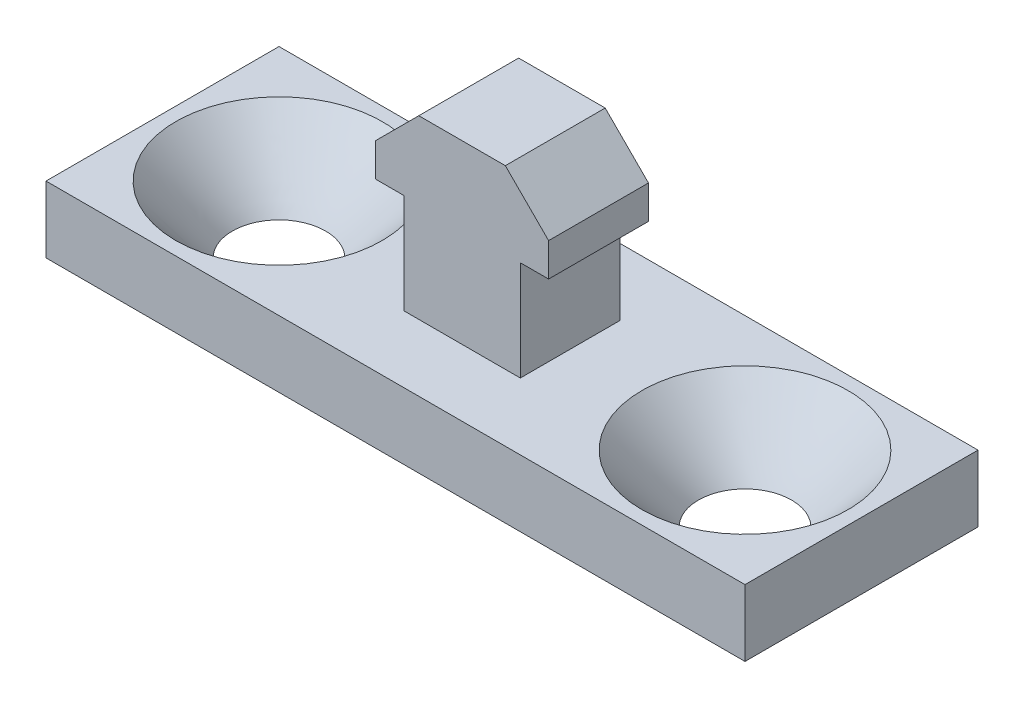
ISO-10303-21;
HEADER;
FILE_DESCRIPTION(('STEP AP214'),'2;1');
FILE_NAME('part.step','',(''),(''),'','','');
FILE_SCHEMA(('AUTOMOTIVE_DESIGN { 1 0 10303 214 1 1 1 1 }'));
ENDSEC;
DATA;
#1=APPLICATION_CONTEXT('core data for automotive mechanical design processes');
#2=APPLICATION_PROTOCOL_DEFINITION('international standard','automotive_design',2000,#1);
#3=PRODUCT_CONTEXT('',#1,'mechanical');
#4=PRODUCT('Part','Part','',(#3));
#5=PRODUCT_RELATED_PRODUCT_CATEGORY('part','',(#4));
#6=PRODUCT_DEFINITION_FORMATION('','',#4);
#7=PRODUCT_DEFINITION_CONTEXT('part definition',#1,'design');
#8=PRODUCT_DEFINITION('design','',#6,#7);
#9=PRODUCT_DEFINITION_SHAPE('','',#8);
#10=(LENGTH_UNIT() NAMED_UNIT(*) SI_UNIT(.MILLI.,.METRE.));
#11=(NAMED_UNIT(*) PLANE_ANGLE_UNIT() SI_UNIT($,.RADIAN.));
#12=(NAMED_UNIT(*) SI_UNIT($,.STERADIAN.) SOLID_ANGLE_UNIT());
#13=UNCERTAINTY_MEASURE_WITH_UNIT(LENGTH_MEASURE(1.E-05),#10,'distance_accuracy_value','');
#14=(GEOMETRIC_REPRESENTATION_CONTEXT(3) GLOBAL_UNCERTAINTY_ASSIGNED_CONTEXT((#13)) GLOBAL_UNIT_ASSIGNED_CONTEXT((#10,
#11,#12)) REPRESENTATION_CONTEXT('',''));
#15=CARTESIAN_POINT('',(0.,0.,0.));
#16=DIRECTION('',(0.,0.,1.));
#17=DIRECTION('',(1.,0.,0.));
#18=AXIS2_PLACEMENT_3D('',#15,#16,#17);
#19=CARTESIAN_POINT('',(0.,2.,0.));
#20=DIRECTION('',(0.,-1.,0.));
#21=DIRECTION('',(0.,0.,-1.));
#22=AXIS2_PLACEMENT_3D('',#19,#20,#21);
#23=PLANE('',#22);
#24=DIRECTION('',(0.,0.,-1.));
#25=VECTOR('',#24,1.);
#26=CARTESIAN_POINT('',(10.5,2.,3.5));
#27=LINE('',#26,#25);
#28=CARTESIAN_POINT('',(10.5,2.,3.5));
#29=VERTEX_POINT('',#28);
#30=CARTESIAN_POINT('',(10.5,2.,-3.5));
#31=VERTEX_POINT('',#30);
#32=EDGE_CURVE('E307',#29,#31,#27,.T.);
#33=ORIENTED_EDGE('',*,*,#32,.T.);
#34=DIRECTION('',(-1.,0.,0.));
#35=VECTOR('',#34,1.);
#36=CARTESIAN_POINT('',(-10.5,2.,-3.5));
#37=LINE('',#36,#35);
#38=CARTESIAN_POINT('',(-10.5,2.,-3.5));
#39=VERTEX_POINT('',#38);
#40=EDGE_CURVE('E310',#31,#39,#37,.T.);
#41=ORIENTED_EDGE('',*,*,#40,.T.);
#42=DIRECTION('',(0.,0.,1.));
#43=VECTOR('',#42,1.);
#44=CARTESIAN_POINT('',(-10.5,2.,3.5));
#45=LINE('',#44,#43);
#46=CARTESIAN_POINT('',(-10.5,2.,3.5));
#47=VERTEX_POINT('',#46);
#48=EDGE_CURVE('E313',#39,#47,#45,.T.);
#49=ORIENTED_EDGE('',*,*,#48,.T.);
#50=DIRECTION('',(1.,0.,0.));
#51=VECTOR('',#50,1.);
#52=CARTESIAN_POINT('',(-10.5,2.,3.5));
#53=LINE('',#52,#51);
#54=EDGE_CURVE('E315',#47,#29,#53,.T.);
#55=ORIENTED_EDGE('',*,*,#54,.T.);
#56=EDGE_LOOP('',(#33,#41,#49,#55));
#57=FACE_BOUND('',#56,.T.);
#58=CARTESIAN_POINT('',(-7.,2.,0.));
#59=DIRECTION('',(0.,1.,0.));
#60=DIRECTION('',(0.,0.,1.));
#61=AXIS2_PLACEMENT_3D('',#58,#59,#60);
#62=CIRCLE('',#61,3.1);
#63=CARTESIAN_POINT('',(-8.81108614161636,2.,2.51594256445674));
#64=VERTEX_POINT('',#63);
#65=EDGE_CURVE('E272',#64,#64,#62,.T.);
#66=ORIENTED_EDGE('',*,*,#65,.F.);
#67=EDGE_LOOP('',(#66));
#68=FACE_BOUND('',#67,.T.);
#69=CARTESIAN_POINT('',(7.,2.,0.));
#70=DIRECTION('',(0.,-1.,0.));
#71=DIRECTION('',(0.,0.,1.));
#72=AXIS2_PLACEMENT_3D('',#69,#70,#71);
#73=CIRCLE('',#72,3.1);
#74=CARTESIAN_POINT('',(8.81108614161636,2.,2.51594256445674));
#75=VERTEX_POINT('',#74);
#76=EDGE_CURVE('E223',#75,#75,#73,.T.);
#77=ORIENTED_EDGE('',*,*,#76,.T.);
#78=EDGE_LOOP('',(#77));
#79=FACE_BOUND('',#78,.T.);
#80=DIRECTION('',(0.,0.,-1.));
#81=VECTOR('',#80,1.);
#82=CARTESIAN_POINT('',(1.75,2.,1.5));
#83=LINE('',#82,#81);
#84=CARTESIAN_POINT('',(1.75,2.,1.5));
#85=VERTEX_POINT('',#84);
#86=CARTESIAN_POINT('',(1.75,2.,-1.5));
#87=VERTEX_POINT('',#86);
#88=EDGE_CURVE('E188',#85,#87,#83,.T.);
#89=ORIENTED_EDGE('',*,*,#88,.F.);
#90=DIRECTION('',(1.,0.,0.));
#91=VECTOR('',#90,1.);
#92=CARTESIAN_POINT('',(-1.75,2.,1.5));
#93=LINE('',#92,#91);
#94=CARTESIAN_POINT('',(-1.75,2.,1.5));
#95=VERTEX_POINT('',#94);
#96=EDGE_CURVE('E203',#95,#85,#93,.T.);
#97=ORIENTED_EDGE('',*,*,#96,.F.);
#98=DIRECTION('',(0.,0.,1.));
#99=VECTOR('',#98,1.);
#100=CARTESIAN_POINT('',(-1.75,2.,1.5));
#101=LINE('',#100,#99);
#102=CARTESIAN_POINT('',(-1.75,2.,-1.5));
#103=VERTEX_POINT('',#102);
#104=EDGE_CURVE('E62',#103,#95,#101,.T.);
#105=ORIENTED_EDGE('',*,*,#104,.F.);
#106=DIRECTION('',(-1.,0.,0.));
#107=VECTOR('',#106,1.);
#108=CARTESIAN_POINT('',(-1.75,2.,-1.5));
#109=LINE('',#108,#107);
#110=EDGE_CURVE('E57',#87,#103,#109,.T.);
#111=ORIENTED_EDGE('',*,*,#110,.F.);
#112=EDGE_LOOP('',(#89,#97,#105,#111));
#113=FACE_BOUND('',#112,.T.);
#114=ADVANCED_FACE('F38',(#57,#68,#79,#113),#23,.F.);
#115=CARTESIAN_POINT('',(10.5,2.,3.5));
#116=DIRECTION('',(-1.,0.,0.));
#117=DIRECTION('',(0.,0.,1.));
#118=AXIS2_PLACEMENT_3D('',#115,#116,#117);
#119=PLANE('',#118);
#120=DIRECTION('',(0.,0.,-1.));
#121=VECTOR('',#120,1.);
#122=CARTESIAN_POINT('',(10.5,0.,3.5));
#123=LINE('',#122,#121);
#124=CARTESIAN_POINT('',(10.5,0.,3.5));
#125=VERTEX_POINT('',#124);
#126=CARTESIAN_POINT('',(10.5,0.,-3.5));
#127=VERTEX_POINT('',#126);
#128=EDGE_CURVE('E304',#125,#127,#123,.T.);
#129=ORIENTED_EDGE('',*,*,#128,.T.);
#130=DIRECTION('',(0.,-1.,0.));
#131=VECTOR('',#130,1.);
#132=CARTESIAN_POINT('',(10.5,2.,-3.5));
#133=LINE('',#132,#131);
#134=EDGE_CURVE('E12',#31,#127,#133,.T.);
#135=ORIENTED_EDGE('',*,*,#134,.F.);
#136=ORIENTED_EDGE('',*,*,#32,.F.);
#137=DIRECTION('',(0.,-1.,0.));
#138=VECTOR('',#137,1.);
#139=CARTESIAN_POINT('',(10.5,2.,3.5));
#140=LINE('',#139,#138);
#141=EDGE_CURVE('E317',#29,#125,#140,.T.);
#142=ORIENTED_EDGE('',*,*,#141,.T.);
#143=EDGE_LOOP('',(#129,#135,#136,#142));
#144=FACE_BOUND('',#143,.T.);
#145=ADVANCED_FACE('F40',(#144),#119,.F.);
#146=CARTESIAN_POINT('',(-10.5,2.,-3.5));
#147=DIRECTION('',(0.,0.,1.));
#148=DIRECTION('',(1.,0.,0.));
#149=AXIS2_PLACEMENT_3D('',#146,#147,#148);
#150=PLANE('',#149);
#151=DIRECTION('',(-1.,0.,0.));
#152=VECTOR('',#151,1.);
#153=CARTESIAN_POINT('',(-10.5,0.,-3.5));
#154=LINE('',#153,#152);
#155=CARTESIAN_POINT('',(-10.5,0.,-3.5));
#156=VERTEX_POINT('',#155);
#157=EDGE_CURVE('E320',#127,#156,#154,.T.);
#158=ORIENTED_EDGE('',*,*,#157,.T.);
#159=DIRECTION('',(0.,-1.,0.));
#160=VECTOR('',#159,1.);
#161=CARTESIAN_POINT('',(-10.5,2.,-3.5));
#162=LINE('',#161,#160);
#163=EDGE_CURVE('E49',#39,#156,#162,.T.);
#164=ORIENTED_EDGE('',*,*,#163,.F.);
#165=ORIENTED_EDGE('',*,*,#40,.F.);
#166=ORIENTED_EDGE('',*,*,#134,.T.);
#167=EDGE_LOOP('',(#158,#164,#165,#166));
#168=FACE_BOUND('',#167,.T.);
#169=ADVANCED_FACE('F525',(#168),#150,.F.);
#170=CARTESIAN_POINT('',(-10.5,2.,3.5));
#171=DIRECTION('',(1.,0.,0.));
#172=DIRECTION('',(0.,0.,-1.));
#173=AXIS2_PLACEMENT_3D('',#170,#171,#172);
#174=PLANE('',#173);
#175=DIRECTION('',(0.,0.,1.));
#176=VECTOR('',#175,1.);
#177=CARTESIAN_POINT('',(-10.5,0.,3.5));
#178=LINE('',#177,#176);
#179=CARTESIAN_POINT('',(-10.5,0.,3.5));
#180=VERTEX_POINT('',#179);
#181=EDGE_CURVE('E322',#156,#180,#178,.T.);
#182=ORIENTED_EDGE('',*,*,#181,.T.);
#183=DIRECTION('',(0.,-1.,0.));
#184=VECTOR('',#183,1.);
#185=CARTESIAN_POINT('',(-10.5,2.,3.5));
#186=LINE('',#185,#184);
#187=EDGE_CURVE('E327',#47,#180,#186,.T.);
#188=ORIENTED_EDGE('',*,*,#187,.F.);
#189=ORIENTED_EDGE('',*,*,#48,.F.);
#190=ORIENTED_EDGE('',*,*,#163,.T.);
#191=EDGE_LOOP('',(#182,#188,#189,#190));
#192=FACE_BOUND('',#191,.T.);
#193=ADVANCED_FACE('F516',(#192),#174,.F.);
#194=CARTESIAN_POINT('',(-10.5,2.,3.5));
#195=DIRECTION('',(0.,0.,-1.));
#196=DIRECTION('',(-1.,0.,0.));
#197=AXIS2_PLACEMENT_3D('',#194,#195,#196);
#198=PLANE('',#197);
#199=DIRECTION('',(1.,0.,0.));
#200=VECTOR('',#199,1.);
#201=CARTESIAN_POINT('',(-10.5,0.,3.5));
#202=LINE('',#201,#200);
#203=EDGE_CURVE('E311',#180,#125,#202,.T.);
#204=ORIENTED_EDGE('',*,*,#203,.T.);
#205=ORIENTED_EDGE('',*,*,#141,.F.);
#206=ORIENTED_EDGE('',*,*,#54,.F.);
#207=ORIENTED_EDGE('',*,*,#187,.T.);
#208=EDGE_LOOP('',(#204,#205,#206,#207));
#209=FACE_BOUND('',#208,.T.);
#210=ADVANCED_FACE('F348',(#209),#198,.F.);
#211=CARTESIAN_POINT('',(0.,0.,0.));
#212=DIRECTION('',(0.,-1.,0.));
#213=DIRECTION('',(0.,0.,-1.));
#214=AXIS2_PLACEMENT_3D('',#211,#212,#213);
#215=PLANE('',#214);
#216=CARTESIAN_POINT('',(7.,0.,0.));
#217=DIRECTION('',(0.,1.,0.));
#218=DIRECTION('',(0.,0.,-1.));
#219=AXIS2_PLACEMENT_3D('',#216,#217,#218);
#220=CIRCLE('',#219,1.4);
#221=CARTESIAN_POINT('',(7.22161430856377,0.,1.38234839973134));
#222=VERTEX_POINT('',#221);
#223=EDGE_CURVE('E267',#222,#222,#220,.T.);
#224=ORIENTED_EDGE('',*,*,#223,.T.);
#225=EDGE_LOOP('',(#224));
#226=FACE_BOUND('',#225,.T.);
#227=CARTESIAN_POINT('',(-7.,0.,0.));
#228=DIRECTION('',(0.,-1.,0.));
#229=DIRECTION('',(0.,0.,-1.));
#230=AXIS2_PLACEMENT_3D('',#227,#228,#229);
#231=CIRCLE('',#230,1.4);
#232=CARTESIAN_POINT('',(-7.22161430856377,0.,1.38234839973134));
#233=VERTEX_POINT('',#232);
#234=EDGE_CURVE('E291',#233,#233,#231,.T.);
#235=ORIENTED_EDGE('',*,*,#234,.F.);
#236=EDGE_LOOP('',(#235));
#237=FACE_BOUND('',#236,.T.);
#238=ORIENTED_EDGE('',*,*,#128,.F.);
#239=ORIENTED_EDGE('',*,*,#203,.F.);
#240=ORIENTED_EDGE('',*,*,#181,.F.);
#241=ORIENTED_EDGE('',*,*,#157,.F.);
#242=EDGE_LOOP('',(#238,#239,#240,#241));
#243=FACE_BOUND('',#242,.T.);
#244=ADVANCED_FACE('F339',(#226,#237,#243),#215,.T.);
#245=CARTESIAN_POINT('',(-8.81108614161636,2.,2.51594256445674));
#246=CARTESIAN_POINT('',(-7.22161430856377,0.,1.38234839973134));
#247=CARTESIAN_POINT('',(-13.8429712705298,2.,-1.10622971877598));
#248=CARTESIAN_POINT('',(-9.98631110802646,0.,0.939119782603799));
#249=CARTESIAN_POINT('',(-10.2207989872971,2.,-6.13811484768946));
#250=CARTESIAN_POINT('',(-9.54308249089891,0.,-1.82557701685889));
#251=CARTESIAN_POINT('',(-5.18891385838364,2.,-2.51594256445674));
#252=CARTESIAN_POINT('',(-6.77838569143623,0.,-1.38234839973134));
#253=CARTESIAN_POINT('',(-0.157028729470159,2.,1.10622971877598));
#254=CARTESIAN_POINT('',(-4.01368889197354,0.,-0.939119782603796));
#255=CARTESIAN_POINT('',(-3.77920101270288,2.,6.13811484768946));
#256=CARTESIAN_POINT('',(-4.45691750910109,0.,1.82557701685889));
#257=CARTESIAN_POINT('',(-8.81108614161636,2.,2.51594256445674));
#258=CARTESIAN_POINT('',(-7.22161430856377,0.,1.38234839973134));
#259=(BOUNDED_SURFACE() B_SPLINE_SURFACE(3,1,((#245,#246),(#247,#248),(#249,#250),(#251,#252),
(#253,#254),(#255,#256),(#257,#258)),.UNSPECIFIED.,.T.,.F.,.F.) B_SPLINE_SURFACE_WITH_KNOTS((4,
3,4),(2,2),(0.,0.5,1.),(0.,1.),
.UNSPECIFIED.) GEOMETRIC_REPRESENTATION_ITEM() RATIONAL_B_SPLINE_SURFACE(((1.,1.),
(0.333333333333333,0.333333333333333),(0.333333333333333,0.333333333333333),(1.,1.),
(0.333333333333333,0.333333333333333),(0.333333333333333,0.333333333333333),(1.,1.))) REPRESENTATION_ITEM('') SURFACE());
#260=CARTESIAN_POINT('',(-8.81108614161636,2.,2.51594256445674));
#261=CARTESIAN_POINT('',(-8.7945291433554,1.97916666666667,2.50413429190752));
#262=CARTESIAN_POINT('',(-8.77797214509443,1.95833333333333,2.49232601935829));
#263=CARTESIAN_POINT('',(-8.7448581485725,1.91666666666667,2.46870947425985));
#264=CARTESIAN_POINT('',(-8.72830115031154,1.89583333333333,2.45690120171063));
#265=CARTESIAN_POINT('',(-8.69518715378961,1.85416666666667,2.43328465661218));
#266=CARTESIAN_POINT('',(-8.67863015552865,1.83333333333333,2.42147638406296));
#267=CARTESIAN_POINT('',(-8.64551615900672,1.79166666666667,2.39785983896451));
#268=CARTESIAN_POINT('',(-8.62895916074575,1.77083333333333,2.38605156641529));
#269=CARTESIAN_POINT('',(-8.59584516422382,1.72916666666667,2.36243502131684));
#270=CARTESIAN_POINT('',(-8.57928816596286,1.70833333333333,2.35062674876762));
#271=CARTESIAN_POINT('',(-8.54617416944093,1.66666666666667,2.32701020366917));
#272=CARTESIAN_POINT('',(-8.52961717117996,1.64583333333333,2.31520193111995));
#273=CARTESIAN_POINT('',(-8.49650317465804,1.60416666666667,2.29158538602151));
#274=CARTESIAN_POINT('',(-8.47994617639707,1.58333333333333,2.27977711347228));
#275=CARTESIAN_POINT('',(-8.44683217987514,1.54166666666667,2.25616056837384));
#276=CARTESIAN_POINT('',(-8.43027518161418,1.52083333333333,2.24435229582461));
#277=CARTESIAN_POINT('',(-8.39716118509225,1.47916666666667,2.22073575072617));
#278=CARTESIAN_POINT('',(-8.38060418683128,1.45833333333333,2.20892747817695));
#279=CARTESIAN_POINT('',(-8.34749019030936,1.41666666666667,2.1853109330785));
#280=CARTESIAN_POINT('',(-8.33093319204839,1.39583333333333,2.17350266052928));
#281=CARTESIAN_POINT('',(-8.29781919552646,1.35416666666667,2.14988611543083));
#282=CARTESIAN_POINT('',(-8.2812621972655,1.33333333333333,2.13807784288161));
#283=CARTESIAN_POINT('',(-8.24814820074357,1.29166666666667,2.11446129778316));
#284=CARTESIAN_POINT('',(-8.2315912024826,1.27083333333333,2.10265302523394));
#285=CARTESIAN_POINT('',(-8.19847720596067,1.22916666666667,2.07903648013549));
#286=CARTESIAN_POINT('',(-8.18192020769971,1.20833333333333,2.06722820758627));
#287=CARTESIAN_POINT('',(-8.14880621117778,1.16666666666667,2.04361166248783));
#288=CARTESIAN_POINT('',(-8.13224921291682,1.14583333333333,2.0318033899386));
#289=CARTESIAN_POINT('',(-8.09913521639489,1.10416666666667,2.00818684484016));
#290=CARTESIAN_POINT('',(-8.08257821813392,1.08333333333333,1.99637857229093));
#291=CARTESIAN_POINT('',(-8.04946422161199,1.04166666666667,1.97276202719249));
#292=CARTESIAN_POINT('',(-8.03290722335103,1.02083333333333,1.96095375464326));
#293=CARTESIAN_POINT('',(-7.9997932268291,0.979166666666667,1.93733720954482));
#294=CARTESIAN_POINT('',(-7.98323622856814,0.958333333333333,1.9255289369956));
#295=CARTESIAN_POINT('',(-7.95012223204621,0.916666666666667,1.90191239189715));
#296=CARTESIAN_POINT('',(-7.93356523378524,0.895833333333333,1.89010411934793));
#297=CARTESIAN_POINT('',(-7.90045123726331,0.854166666666667,1.86648757424948));
#298=CARTESIAN_POINT('',(-7.88389423900235,0.833333333333333,1.85467930170026));
#299=CARTESIAN_POINT('',(-7.85078024248042,0.791666666666667,1.83106275660181));
#300=CARTESIAN_POINT('',(-7.83422324421946,0.770833333333333,1.81925448405259));
#301=CARTESIAN_POINT('',(-7.80110924769753,0.729166666666667,1.79563793895414));
#302=CARTESIAN_POINT('',(-7.78455224943656,0.708333333333333,1.78382966640492));
#303=CARTESIAN_POINT('',(-7.75143825291463,0.666666666666667,1.76021312130648));
#304=CARTESIAN_POINT('',(-7.73488125465367,0.645833333333333,1.74840484875725));
#305=CARTESIAN_POINT('',(-7.70176725813174,0.604166666666667,1.72478830365881));
#306=CARTESIAN_POINT('',(-7.68521025987078,0.583333333333333,1.71298003110958));
#307=CARTESIAN_POINT('',(-7.65209626334885,0.541666666666667,1.68936348601114));
#308=CARTESIAN_POINT('',(-7.63553926508788,0.520833333333333,1.67755521346191));
#309=CARTESIAN_POINT('',(-7.60242526856595,0.479166666666667,1.65393866836347));
#310=CARTESIAN_POINT('',(-7.58586827030499,0.458333333333333,1.64213039581425));
#311=CARTESIAN_POINT('',(-7.55275427378306,0.416666666666667,1.6185138507158));
#312=CARTESIAN_POINT('',(-7.5361972755221,0.395833333333333,1.60670557816658));
#313=CARTESIAN_POINT('',(-7.50308327900017,0.354166666666667,1.58308903306813));
#314=CARTESIAN_POINT('',(-7.4865262807392,0.333333333333333,1.57128076051891));
#315=CARTESIAN_POINT('',(-7.45341228421727,0.291666666666667,1.54766421542046));
#316=CARTESIAN_POINT('',(-7.43685528595631,0.270833333333333,1.53585594287124));
#317=CARTESIAN_POINT('',(-7.40374128943438,0.229166666666667,1.51223939777279));
#318=CARTESIAN_POINT('',(-7.38718429117342,0.208333333333333,1.50043112522357));
#319=CARTESIAN_POINT('',(-7.35407029465149,0.166666666666667,1.47681458012513));
#320=CARTESIAN_POINT('',(-7.33751329639052,0.145833333333333,1.4650063075759));
#321=CARTESIAN_POINT('',(-7.30439929986859,0.104166666666667,1.44138976247746));
#322=CARTESIAN_POINT('',(-7.28784230160763,0.0833333333333334,1.42958148992823));
#323=CARTESIAN_POINT('',(-7.2547283050857,0.0416666666666666,1.40596494482979));
#324=CARTESIAN_POINT('',(-7.23817130682474,0.0208333333333333,1.39415667228056));
#325=CARTESIAN_POINT('',(-7.22161430856377,0.,1.38234839973134));
#326=B_SPLINE_CURVE_WITH_KNOTS('',3,(#260,#261,#262,#263,#264,#265,#266,#267,#268,#269,#270,
#271,#272,#273,#274,#275,#276,#277,#278,#279,#280,#281,#282,#283,#284,#285,#286,#287,#288,#289,
#290,#291,#292,#293,#294,#295,#296,#297,#298,#299,#300,#301,#302,#303,#304,#305,#306,#307,#308,
#309,#310,#311,#312,#313,#314,#315,#316,#317,#318,#319,#320,#321,#322,#323,#324,#325),
.UNSPECIFIED.,.F.,.F.,(4,2,2,2,2,2,2,2,2,2,2,2,2,2,2,2,2,2,2,2,2,2,2,2,2,2,2,2,2,2,2,2,4),(0.,
0.0873405714893874,0.174681142978775,0.262021714468162,0.34936228595755,0.436702857446938,
0.524043428936325,0.611384000425712,0.6987245719151,0.786065143404487,0.873405714893874,
0.960746286383263,1.04808685787265,1.13542742936204,1.22276800085142,1.31010857234081,
1.3974491438302,1.48478971531959,1.57213028680898,1.65947085829836,1.74681142978775,
1.83415200127714,1.92149257276652,2.00883314425591,2.0961737157453,2.18351428723469,
2.27085485872407,2.35819543021346,2.44553600170285,2.53287657319224,2.62021714468163,
2.70755771617101,2.7948982876604),.UNSPECIFIED.);
#327=EDGE_CURVE('BSEAM247',#64,#233,#326,.T.);
#328=ORIENTED_EDGE('',*,*,#65,.T.);
#329=ORIENTED_EDGE('',*,*,#234,.T.);
#330=ORIENTED_EDGE('',*,*,#327,.T.);
#331=ORIENTED_EDGE('',*,*,#327,.F.);
#332=EDGE_LOOP('',(#328,#330,#329,#331));
#333=FACE_BOUND('',#332,.T.);
#334=ADVANCED_FACE('F247',(#333),#259,.F.);
#335=CARTESIAN_POINT('',(8.81108614161636,2.,2.51594256445674));
#336=CARTESIAN_POINT('',(7.22161430856377,0.,1.38234839973134));
#337=CARTESIAN_POINT('',(13.8429712705298,2.,-1.10622971877598));
#338=CARTESIAN_POINT('',(9.98631110802646,0.,0.939119782603799));
#339=CARTESIAN_POINT('',(10.2207989872971,2.,-6.13811484768946));
#340=CARTESIAN_POINT('',(9.54308249089891,0.,-1.82557701685889));
#341=CARTESIAN_POINT('',(5.18891385838364,2.,-2.51594256445674));
#342=CARTESIAN_POINT('',(6.77838569143623,0.,-1.38234839973134));
#343=CARTESIAN_POINT('',(0.157028729470159,2.,1.10622971877598));
#344=CARTESIAN_POINT('',(4.01368889197354,0.,-0.939119782603796));
#345=CARTESIAN_POINT('',(3.77920101270288,2.,6.13811484768946));
#346=CARTESIAN_POINT('',(4.45691750910109,0.,1.82557701685889));
#347=CARTESIAN_POINT('',(8.81108614161636,2.,2.51594256445674));
#348=CARTESIAN_POINT('',(7.22161430856377,0.,1.38234839973134));
#349=(BOUNDED_SURFACE() B_SPLINE_SURFACE(3,1,((#335,#336),(#337,#338),(#339,#340),(#341,#342),
(#343,#344),(#345,#346),(#347,#348)),.UNSPECIFIED.,.T.,.F.,.F.) B_SPLINE_SURFACE_WITH_KNOTS((4,
3,4),(2,2),(0.,0.5,1.),(0.,1.),
.UNSPECIFIED.) GEOMETRIC_REPRESENTATION_ITEM() RATIONAL_B_SPLINE_SURFACE(((1.,1.),
(0.333333333333333,0.333333333333333),(0.333333333333333,0.333333333333333),(1.,1.),
(0.333333333333333,0.333333333333333),(0.333333333333333,0.333333333333333),(1.,1.))) REPRESENTATION_ITEM('') SURFACE());
#350=CARTESIAN_POINT('',(8.81108614161636,2.,2.51594256445674));
#351=CARTESIAN_POINT('',(8.7945291433554,1.97916666666667,2.50413429190752));
#352=CARTESIAN_POINT('',(8.77797214509443,1.95833333333333,2.49232601935829));
#353=CARTESIAN_POINT('',(8.7448581485725,1.91666666666667,2.46870947425985));
#354=CARTESIAN_POINT('',(8.72830115031154,1.89583333333333,2.45690120171063));
#355=CARTESIAN_POINT('',(8.69518715378961,1.85416666666667,2.43328465661218));
#356=CARTESIAN_POINT('',(8.67863015552865,1.83333333333333,2.42147638406296));
#357=CARTESIAN_POINT('',(8.64551615900672,1.79166666666667,2.39785983896451));
#358=CARTESIAN_POINT('',(8.62895916074575,1.77083333333333,2.38605156641529));
#359=CARTESIAN_POINT('',(8.59584516422382,1.72916666666667,2.36243502131684));
#360=CARTESIAN_POINT('',(8.57928816596286,1.70833333333333,2.35062674876762));
#361=CARTESIAN_POINT('',(8.54617416944093,1.66666666666667,2.32701020366917));
#362=CARTESIAN_POINT('',(8.52961717117996,1.64583333333333,2.31520193111995));
#363=CARTESIAN_POINT('',(8.49650317465804,1.60416666666667,2.29158538602151));
#364=CARTESIAN_POINT('',(8.47994617639707,1.58333333333333,2.27977711347228));
#365=CARTESIAN_POINT('',(8.44683217987514,1.54166666666667,2.25616056837384));
#366=CARTESIAN_POINT('',(8.43027518161418,1.52083333333333,2.24435229582461));
#367=CARTESIAN_POINT('',(8.39716118509225,1.47916666666667,2.22073575072617));
#368=CARTESIAN_POINT('',(8.38060418683128,1.45833333333333,2.20892747817695));
#369=CARTESIAN_POINT('',(8.34749019030936,1.41666666666667,2.1853109330785));
#370=CARTESIAN_POINT('',(8.33093319204839,1.39583333333333,2.17350266052928));
#371=CARTESIAN_POINT('',(8.29781919552646,1.35416666666667,2.14988611543083));
#372=CARTESIAN_POINT('',(8.2812621972655,1.33333333333333,2.13807784288161));
#373=CARTESIAN_POINT('',(8.24814820074357,1.29166666666667,2.11446129778316));
#374=CARTESIAN_POINT('',(8.2315912024826,1.27083333333333,2.10265302523394));
#375=CARTESIAN_POINT('',(8.19847720596067,1.22916666666667,2.07903648013549));
#376=CARTESIAN_POINT('',(8.18192020769971,1.20833333333333,2.06722820758627));
#377=CARTESIAN_POINT('',(8.14880621117778,1.16666666666667,2.04361166248783));
#378=CARTESIAN_POINT('',(8.13224921291682,1.14583333333333,2.0318033899386));
#379=CARTESIAN_POINT('',(8.09913521639489,1.10416666666667,2.00818684484016));
#380=CARTESIAN_POINT('',(8.08257821813392,1.08333333333333,1.99637857229093));
#381=CARTESIAN_POINT('',(8.04946422161199,1.04166666666667,1.97276202719249));
#382=CARTESIAN_POINT('',(8.03290722335103,1.02083333333333,1.96095375464326));
#383=CARTESIAN_POINT('',(7.9997932268291,0.979166666666667,1.93733720954482));
#384=CARTESIAN_POINT('',(7.98323622856814,0.958333333333333,1.9255289369956));
#385=CARTESIAN_POINT('',(7.95012223204621,0.916666666666667,1.90191239189715));
#386=CARTESIAN_POINT('',(7.93356523378524,0.895833333333333,1.89010411934793));
#387=CARTESIAN_POINT('',(7.90045123726331,0.854166666666667,1.86648757424948));
#388=CARTESIAN_POINT('',(7.88389423900235,0.833333333333333,1.85467930170026));
#389=CARTESIAN_POINT('',(7.85078024248042,0.791666666666667,1.83106275660181));
#390=CARTESIAN_POINT('',(7.83422324421946,0.770833333333333,1.81925448405259));
#391=CARTESIAN_POINT('',(7.80110924769753,0.729166666666667,1.79563793895414));
#392=CARTESIAN_POINT('',(7.78455224943656,0.708333333333333,1.78382966640492));
#393=CARTESIAN_POINT('',(7.75143825291463,0.666666666666667,1.76021312130648));
#394=CARTESIAN_POINT('',(7.73488125465367,0.645833333333333,1.74840484875725));
#395=CARTESIAN_POINT('',(7.70176725813174,0.604166666666667,1.72478830365881));
#396=CARTESIAN_POINT('',(7.68521025987078,0.583333333333333,1.71298003110958));
#397=CARTESIAN_POINT('',(7.65209626334885,0.541666666666667,1.68936348601114));
#398=CARTESIAN_POINT('',(7.63553926508788,0.520833333333333,1.67755521346191));
#399=CARTESIAN_POINT('',(7.60242526856595,0.479166666666667,1.65393866836347));
#400=CARTESIAN_POINT('',(7.58586827030499,0.458333333333333,1.64213039581425));
#401=CARTESIAN_POINT('',(7.55275427378306,0.416666666666667,1.6185138507158));
#402=CARTESIAN_POINT('',(7.5361972755221,0.395833333333333,1.60670557816658));
#403=CARTESIAN_POINT('',(7.50308327900017,0.354166666666667,1.58308903306813));
#404=CARTESIAN_POINT('',(7.4865262807392,0.333333333333333,1.57128076051891));
#405=CARTESIAN_POINT('',(7.45341228421727,0.291666666666667,1.54766421542046));
#406=CARTESIAN_POINT('',(7.43685528595631,0.270833333333333,1.53585594287124));
#407=CARTESIAN_POINT('',(7.40374128943438,0.229166666666667,1.51223939777279));
#408=CARTESIAN_POINT('',(7.38718429117342,0.208333333333333,1.50043112522357));
#409=CARTESIAN_POINT('',(7.35407029465149,0.166666666666667,1.47681458012513));
#410=CARTESIAN_POINT('',(7.33751329639052,0.145833333333333,1.4650063075759));
#411=CARTESIAN_POINT('',(7.30439929986859,0.104166666666667,1.44138976247746));
#412=CARTESIAN_POINT('',(7.28784230160763,0.0833333333333334,1.42958148992823));
#413=CARTESIAN_POINT('',(7.2547283050857,0.0416666666666666,1.40596494482979));
#414=CARTESIAN_POINT('',(7.23817130682474,0.0208333333333333,1.39415667228056));
#415=CARTESIAN_POINT('',(7.22161430856377,0.,1.38234839973134));
#416=B_SPLINE_CURVE_WITH_KNOTS('',3,(#350,#351,#352,#353,#354,#355,#356,#357,#358,#359,#360,
#361,#362,#363,#364,#365,#366,#367,#368,#369,#370,#371,#372,#373,#374,#375,#376,#377,#378,#379,
#380,#381,#382,#383,#384,#385,#386,#387,#388,#389,#390,#391,#392,#393,#394,#395,#396,#397,#398,
#399,#400,#401,#402,#403,#404,#405,#406,#407,#408,#409,#410,#411,#412,#413,#414,#415),
.UNSPECIFIED.,.F.,.F.,(4,2,2,2,2,2,2,2,2,2,2,2,2,2,2,2,2,2,2,2,2,2,2,2,2,2,2,2,2,2,2,2,4),(0.,
0.0873405714893874,0.174681142978775,0.262021714468162,0.34936228595755,0.436702857446938,
0.524043428936325,0.611384000425712,0.6987245719151,0.786065143404487,0.873405714893874,
0.960746286383263,1.04808685787265,1.13542742936204,1.22276800085142,1.31010857234081,
1.3974491438302,1.48478971531959,1.57213028680898,1.65947085829836,1.74681142978775,
1.83415200127714,1.92149257276652,2.00883314425591,2.0961737157453,2.18351428723469,
2.27085485872407,2.35819543021346,2.44553600170285,2.53287657319224,2.62021714468163,
2.70755771617101,2.7948982876604),.UNSPECIFIED.);
#417=EDGE_CURVE('BSEAM234',#75,#222,#416,.T.);
#418=ORIENTED_EDGE('',*,*,#76,.F.);
#419=ORIENTED_EDGE('',*,*,#223,.F.);
#420=ORIENTED_EDGE('',*,*,#417,.T.);
#421=ORIENTED_EDGE('',*,*,#417,.F.);
#422=EDGE_LOOP('',(#418,#420,#419,#421));
#423=FACE_BOUND('',#422,.T.);
#424=ADVANCED_FACE('F234',(#423),#349,.T.);
#425=CARTESIAN_POINT('',(1.75,5.,1.5));
#426=DIRECTION('',(-1.,0.,0.));
#427=DIRECTION('',(0.,0.,1.));
#428=AXIS2_PLACEMENT_3D('',#425,#426,#427);
#429=PLANE('',#428);
#430=ORIENTED_EDGE('',*,*,#88,.T.);
#431=DIRECTION('',(0.,-1.,0.));
#432=VECTOR('',#431,1.);
#433=CARTESIAN_POINT('',(1.75,5.,-1.5));
#434=LINE('',#433,#432);
#435=CARTESIAN_POINT('',(1.75,5.,-1.5));
#436=VERTEX_POINT('',#435);
#437=EDGE_CURVE('E221',#436,#87,#434,.T.);
#438=ORIENTED_EDGE('',*,*,#437,.F.);
#439=DIRECTION('',(0.,0.,-1.));
#440=VECTOR('',#439,1.);
#441=CARTESIAN_POINT('',(1.75,5.,1.5));
#442=LINE('',#441,#440);
#443=CARTESIAN_POINT('',(1.75,5.,1.5));
#444=VERTEX_POINT('',#443);
#445=EDGE_CURVE('E199',#444,#436,#442,.T.);
#446=ORIENTED_EDGE('',*,*,#445,.F.);
#447=DIRECTION('',(0.,-1.,0.));
#448=VECTOR('',#447,1.);
#449=CARTESIAN_POINT('',(1.75,5.,1.5));
#450=LINE('',#449,#448);
#451=EDGE_CURVE('E206',#444,#85,#450,.T.);
#452=ORIENTED_EDGE('',*,*,#451,.T.);
#453=EDGE_LOOP('',(#430,#438,#446,#452));
#454=FACE_BOUND('',#453,.T.);
#455=ADVANCED_FACE('F246',(#454),#429,.F.);
#456=CARTESIAN_POINT('',(-1.75,5.,-1.5));
#457=DIRECTION('',(0.,0.,1.));
#458=DIRECTION('',(1.,0.,0.));
#459=AXIS2_PLACEMENT_3D('',#456,#457,#458);
#460=PLANE('',#459);
#461=ORIENTED_EDGE('',*,*,#110,.T.);
#462=DIRECTION('',(0.,-1.,0.));
#463=VECTOR('',#462,1.);
#464=CARTESIAN_POINT('',(-1.75,5.,-1.5));
#465=LINE('',#464,#463);
#466=CARTESIAN_POINT('',(-1.75,5.,-1.5));
#467=VERTEX_POINT('',#466);
#468=EDGE_CURVE('E218',#467,#103,#465,.T.);
#469=ORIENTED_EDGE('',*,*,#468,.F.);
#470=DIRECTION('',(-1.,0.,0.));
#471=VECTOR('',#470,1.);
#472=CARTESIAN_POINT('',(-2.6,5.,-1.5));
#473=LINE('',#472,#471);
#474=CARTESIAN_POINT('',(-2.6,5.,-1.5));
#475=VERTEX_POINT('',#474);
#476=EDGE_CURVE('E389',#467,#475,#473,.T.);
#477=ORIENTED_EDGE('',*,*,#476,.T.);
#478=DIRECTION('',(0.,1.,0.));
#479=VECTOR('',#478,1.);
#480=CARTESIAN_POINT('',(-2.6,5.,-1.5));
#481=LINE('',#480,#479);
#482=CARTESIAN_POINT('',(-2.6,6.,-1.5));
#483=VERTEX_POINT('',#482);
#484=EDGE_CURVE('E392',#475,#483,#481,.T.);
#485=ORIENTED_EDGE('',*,*,#484,.T.);
#486=DIRECTION('',(0.707106781186555,0.70710678118654,0.));
#487=VECTOR('',#486,1.);
#488=CARTESIAN_POINT('',(-2.6,6.,-1.5));
#489=LINE('',#488,#487);
#490=CARTESIAN_POINT('',(-1.3,7.29999999999997,-1.5));
#491=VERTEX_POINT('',#490);
#492=EDGE_CURVE('E163',#483,#491,#489,.T.);
#493=ORIENTED_EDGE('',*,*,#492,.T.);
#494=DIRECTION('',(1.,0.,0.));
#495=VECTOR('',#494,1.);
#496=CARTESIAN_POINT('',(-1.3,7.29999999999997,-1.5));
#497=LINE('',#496,#495);
#498=CARTESIAN_POINT('',(1.3,7.29999999999997,-1.5));
#499=VERTEX_POINT('',#498);
#500=EDGE_CURVE('E146',#491,#499,#497,.T.);
#501=ORIENTED_EDGE('',*,*,#500,.T.);
#502=DIRECTION('',(0.707106781186555,-0.70710678118654,0.));
#503=VECTOR('',#502,1.);
#504=CARTESIAN_POINT('',(2.6,6.,-1.5));
#505=LINE('',#504,#503);
#506=CARTESIAN_POINT('',(2.6,6.,-1.5));
#507=VERTEX_POINT('',#506);
#508=EDGE_CURVE('E159',#499,#507,#505,.T.);
#509=ORIENTED_EDGE('',*,*,#508,.T.);
#510=DIRECTION('',(0.,-1.,0.));
#511=VECTOR('',#510,1.);
#512=CARTESIAN_POINT('',(2.6,5.,-1.5));
#513=LINE('',#512,#511);
#514=CARTESIAN_POINT('',(2.6,5.,-1.5));
#515=VERTEX_POINT('',#514);
#516=EDGE_CURVE('E168',#507,#515,#513,.T.);
#517=ORIENTED_EDGE('',*,*,#516,.T.);
#518=EDGE_CURVE('E172',#515,#436,#473,.T.);
#519=ORIENTED_EDGE('',*,*,#518,.T.);
#520=ORIENTED_EDGE('',*,*,#437,.T.);
#521=EDGE_LOOP('',(#461,#469,#477,#485,#493,#501,#509,#517,#519,#520));
#522=FACE_BOUND('',#521,.T.);
#523=ADVANCED_FACE('F157',(#522),#460,.F.);
#524=CARTESIAN_POINT('',(-1.75,5.,1.5));
#525=DIRECTION('',(1.,0.,0.));
#526=DIRECTION('',(0.,0.,-1.));
#527=AXIS2_PLACEMENT_3D('',#524,#525,#526);
#528=PLANE('',#527);
#529=ORIENTED_EDGE('',*,*,#104,.T.);
#530=DIRECTION('',(0.,-1.,0.));
#531=VECTOR('',#530,1.);
#532=CARTESIAN_POINT('',(-1.75,5.,1.5));
#533=LINE('',#532,#531);
#534=CARTESIAN_POINT('',(-1.75,5.,1.5));
#535=VERTEX_POINT('',#534);
#536=EDGE_CURVE('E215',#535,#95,#533,.T.);
#537=ORIENTED_EDGE('',*,*,#536,.F.);
#538=DIRECTION('',(0.,0.,1.));
#539=VECTOR('',#538,1.);
#540=CARTESIAN_POINT('',(-1.75,5.,1.5));
#541=LINE('',#540,#539);
#542=EDGE_CURVE('E202',#467,#535,#541,.T.);
#543=ORIENTED_EDGE('',*,*,#542,.F.);
#544=ORIENTED_EDGE('',*,*,#468,.T.);
#545=EDGE_LOOP('',(#529,#537,#543,#544));
#546=FACE_BOUND('',#545,.T.);
#547=ADVANCED_FACE('F391',(#546),#528,.F.);
#548=CARTESIAN_POINT('',(-1.75,5.,1.5));
#549=DIRECTION('',(0.,0.,-1.));
#550=DIRECTION('',(-1.,0.,0.));
#551=AXIS2_PLACEMENT_3D('',#548,#549,#550);
#552=PLANE('',#551);
#553=ORIENTED_EDGE('',*,*,#96,.T.);
#554=ORIENTED_EDGE('',*,*,#451,.F.);
#555=DIRECTION('',(-1.,0.,0.));
#556=VECTOR('',#555,1.);
#557=CARTESIAN_POINT('',(-2.6,5.,1.5));
#558=LINE('',#557,#556);
#559=CARTESIAN_POINT('',(2.6,5.,1.5));
#560=VERTEX_POINT('',#559);
#561=EDGE_CURVE('E180',#560,#444,#558,.T.);
#562=ORIENTED_EDGE('',*,*,#561,.F.);
#563=DIRECTION('',(0.,-1.,0.));
#564=VECTOR('',#563,1.);
#565=CARTESIAN_POINT('',(2.6,5.,1.5));
#566=LINE('',#565,#564);
#567=CARTESIAN_POINT('',(2.6,6.,1.5));
#568=VERTEX_POINT('',#567);
#569=EDGE_CURVE('E186',#568,#560,#566,.T.);
#570=ORIENTED_EDGE('',*,*,#569,.F.);
#571=DIRECTION('',(0.707106781186555,-0.70710678118654,0.));
#572=VECTOR('',#571,1.);
#573=CARTESIAN_POINT('',(2.6,6.,1.5));
#574=LINE('',#573,#572);
#575=CARTESIAN_POINT('',(1.3,7.29999999999997,1.5));
#576=VERTEX_POINT('',#575);
#577=EDGE_CURVE('E184',#576,#568,#574,.T.);
#578=ORIENTED_EDGE('',*,*,#577,.F.);
#579=DIRECTION('',(1.,0.,0.));
#580=VECTOR('',#579,1.);
#581=CARTESIAN_POINT('',(-1.3,7.29999999999997,1.5));
#582=LINE('',#581,#580);
#583=CARTESIAN_POINT('',(-1.3,7.29999999999997,1.5));
#584=VERTEX_POINT('',#583);
#585=EDGE_CURVE('E147',#584,#576,#582,.T.);
#586=ORIENTED_EDGE('',*,*,#585,.F.);
#587=DIRECTION('',(0.707106781186555,0.70710678118654,0.));
#588=VECTOR('',#587,1.);
#589=CARTESIAN_POINT('',(-2.6,6.,1.5));
#590=LINE('',#589,#588);
#591=CARTESIAN_POINT('',(-2.6,6.,1.5));
#592=VERTEX_POINT('',#591);
#593=EDGE_CURVE('E179',#592,#584,#590,.T.);
#594=ORIENTED_EDGE('',*,*,#593,.F.);
#595=DIRECTION('',(0.,1.,0.));
#596=VECTOR('',#595,1.);
#597=CARTESIAN_POINT('',(-2.6,5.,1.5));
#598=LINE('',#597,#596);
#599=CARTESIAN_POINT('',(-2.6,5.,1.5));
#600=VERTEX_POINT('',#599);
#601=EDGE_CURVE('E176',#600,#592,#598,.T.);
#602=ORIENTED_EDGE('',*,*,#601,.F.);
#603=EDGE_CURVE('E196',#535,#600,#558,.T.);
#604=ORIENTED_EDGE('',*,*,#603,.F.);
#605=ORIENTED_EDGE('',*,*,#536,.T.);
#606=EDGE_LOOP('',(#553,#554,#562,#570,#578,#586,#594,#602,#604,#605));
#607=FACE_BOUND('',#606,.T.);
#608=ADVANCED_FACE('F367',(#607),#552,.F.);
#609=CARTESIAN_POINT('',(-2.6,5.,7.18594759033179));
#610=DIRECTION('',(0.,1.,0.));
#611=DIRECTION('',(0.,0.,1.));
#612=AXIS2_PLACEMENT_3D('',#609,#610,#611);
#613=PLANE('',#612);
#614=ORIENTED_EDGE('',*,*,#561,.T.);
#615=ORIENTED_EDGE('',*,*,#445,.T.);
#616=ORIENTED_EDGE('',*,*,#518,.F.);
#617=DIRECTION('',(0.,0.,-1.));
#618=VECTOR('',#617,1.);
#619=CARTESIAN_POINT('',(2.6,5.,7.18594759033179));
#620=LINE('',#619,#618);
#621=EDGE_CURVE('E167',#560,#515,#620,.T.);
#622=ORIENTED_EDGE('',*,*,#621,.F.);
#623=EDGE_LOOP('',(#614,#615,#616,#622));
#624=FACE_BOUND('',#623,.T.);
#625=ADVANCED_FACE('F374',(#624),#613,.F.);
#626=ORIENTED_EDGE('',*,*,#476,.F.);
#627=ORIENTED_EDGE('',*,*,#542,.T.);
#628=ORIENTED_EDGE('',*,*,#603,.T.);
#629=DIRECTION('',(0.,0.,-1.));
#630=VECTOR('',#629,1.);
#631=CARTESIAN_POINT('',(-2.6,5.,7.18594759033179));
#632=LINE('',#631,#630);
#633=EDGE_CURVE('E170',#600,#475,#632,.T.);
#634=ORIENTED_EDGE('',*,*,#633,.T.);
#635=EDGE_LOOP('',(#626,#627,#628,#634));
#636=FACE_BOUND('',#635,.T.);
#637=ADVANCED_FACE('F387',(#636),#613,.F.);
#638=CARTESIAN_POINT('',(-2.6,5.,7.18594759033179));
#639=DIRECTION('',(1.,0.,0.));
#640=DIRECTION('',(0.,0.,-1.));
#641=AXIS2_PLACEMENT_3D('',#638,#639,#640);
#642=PLANE('',#641);
#643=ORIENTED_EDGE('',*,*,#633,.F.);
#644=ORIENTED_EDGE('',*,*,#601,.T.);
#645=DIRECTION('',(0.,0.,-1.));
#646=VECTOR('',#645,1.);
#647=CARTESIAN_POINT('',(-2.6,6.,7.18594759033179));
#648=LINE('',#647,#646);
#649=EDGE_CURVE('E192',#592,#483,#648,.T.);
#650=ORIENTED_EDGE('',*,*,#649,.T.);
#651=ORIENTED_EDGE('',*,*,#484,.F.);
#652=EDGE_LOOP('',(#643,#644,#650,#651));
#653=FACE_BOUND('',#652,.T.);
#654=ADVANCED_FACE('F384',(#653),#642,.F.);
#655=CARTESIAN_POINT('',(-2.6,6.,7.18594759033179));
#656=DIRECTION('',(0.70710678118654,-0.707106781186555,0.));
#657=DIRECTION('',(0.707106781186555,0.70710678118654,0.));
#658=AXIS2_PLACEMENT_3D('',#655,#656,#657);
#659=PLANE('',#658);
#660=ORIENTED_EDGE('',*,*,#649,.F.);
#661=ORIENTED_EDGE('',*,*,#593,.T.);
#662=DIRECTION('',(0.,0.,-1.));
#663=VECTOR('',#662,1.);
#664=CARTESIAN_POINT('',(-1.3,7.29999999999997,7.18594759033179));
#665=LINE('',#664,#663);
#666=EDGE_CURVE('E152',#584,#491,#665,.T.);
#667=ORIENTED_EDGE('',*,*,#666,.T.);
#668=ORIENTED_EDGE('',*,*,#492,.F.);
#669=EDGE_LOOP('',(#660,#661,#667,#668));
#670=FACE_BOUND('',#669,.T.);
#671=ADVANCED_FACE('F380',(#670),#659,.F.);
#672=CARTESIAN_POINT('',(-1.3,7.29999999999997,7.18594759033179));
#673=DIRECTION('',(0.,-1.,0.));
#674=DIRECTION('',(0.,0.,-1.));
#675=AXIS2_PLACEMENT_3D('',#672,#673,#674);
#676=PLANE('',#675);
#677=ORIENTED_EDGE('',*,*,#666,.F.);
#678=ORIENTED_EDGE('',*,*,#585,.T.);
#679=DIRECTION('',(0.,0.,-1.));
#680=VECTOR('',#679,1.);
#681=CARTESIAN_POINT('',(1.3,7.29999999999997,7.18594759033179));
#682=LINE('',#681,#680);
#683=EDGE_CURVE('E142',#576,#499,#682,.T.);
#684=ORIENTED_EDGE('',*,*,#683,.T.);
#685=ORIENTED_EDGE('',*,*,#500,.F.);
#686=EDGE_LOOP('',(#677,#678,#684,#685));
#687=FACE_BOUND('',#686,.T.);
#688=ADVANCED_FACE('F145',(#687),#676,.F.);
#689=CARTESIAN_POINT('',(2.6,6.,7.18594759033179));
#690=DIRECTION('',(-0.70710678118654,-0.707106781186555,0.));
#691=DIRECTION('',(0.707106781186555,-0.70710678118654,0.));
#692=AXIS2_PLACEMENT_3D('',#689,#690,#691);
#693=PLANE('',#692);
#694=ORIENTED_EDGE('',*,*,#683,.F.);
#695=ORIENTED_EDGE('',*,*,#577,.T.);
#696=DIRECTION('',(0.,0.,-1.));
#697=VECTOR('',#696,1.);
#698=CARTESIAN_POINT('',(2.6,6.,7.18594759033179));
#699=LINE('',#698,#697);
#700=EDGE_CURVE('E151',#568,#507,#699,.T.);
#701=ORIENTED_EDGE('',*,*,#700,.T.);
#702=ORIENTED_EDGE('',*,*,#508,.F.);
#703=EDGE_LOOP('',(#694,#695,#701,#702));
#704=FACE_BOUND('',#703,.T.);
#705=ADVANCED_FACE('F165',(#704),#693,.F.);
#706=CARTESIAN_POINT('',(2.6,5.,7.18594759033179));
#707=DIRECTION('',(-1.,0.,0.));
#708=DIRECTION('',(0.,0.,1.));
#709=AXIS2_PLACEMENT_3D('',#706,#707,#708);
#710=PLANE('',#709);
#711=ORIENTED_EDGE('',*,*,#700,.F.);
#712=ORIENTED_EDGE('',*,*,#569,.T.);
#713=ORIENTED_EDGE('',*,*,#621,.T.);
#714=ORIENTED_EDGE('',*,*,#516,.F.);
#715=EDGE_LOOP('',(#711,#712,#713,#714));
#716=FACE_BOUND('',#715,.T.);
#717=ADVANCED_FACE('F376',(#716),#710,.F.);
#718=CLOSED_SHELL('',(#114,#145,#169,#193,#210,#244,#334,#424,#455,#523,#547,#608,#625,#637,
#654,#671,#688,#705,#717));
#719=MANIFOLD_SOLID_BREP('B2',#718);
#720=ADVANCED_BREP_SHAPE_REPRESENTATION('',(#18,#719),#14);
#721=SHAPE_DEFINITION_REPRESENTATION(#9,#720);
ENDSEC;
END-ISO-10303-21;
